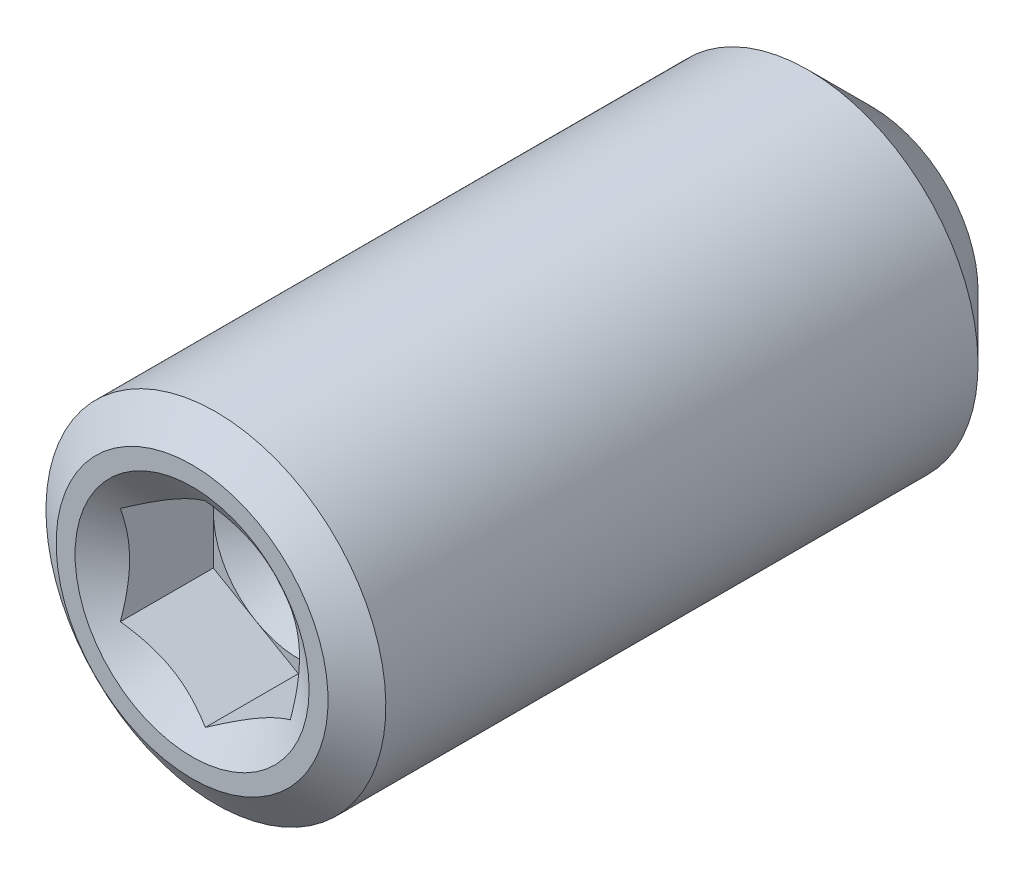
ISO-10303-21;
HEADER;
FILE_DESCRIPTION(('STEP AP214'),'2;1');
FILE_NAME('part.step','',(''),(''),'','','');
FILE_SCHEMA(('AUTOMOTIVE_DESIGN { 1 0 10303 214 1 1 1 1 }'));
ENDSEC;
DATA;
#1=APPLICATION_CONTEXT('core data for automotive mechanical design processes');
#2=APPLICATION_PROTOCOL_DEFINITION('international standard','automotive_design',2000,#1);
#3=PRODUCT_CONTEXT('',#1,'mechanical');
#4=PRODUCT('Part','Part','',(#3));
#5=PRODUCT_RELATED_PRODUCT_CATEGORY('part','',(#4));
#6=PRODUCT_DEFINITION_FORMATION('','',#4);
#7=PRODUCT_DEFINITION_CONTEXT('part definition',#1,'design');
#8=PRODUCT_DEFINITION('design','',#6,#7);
#9=PRODUCT_DEFINITION_SHAPE('','',#8);
#10=(LENGTH_UNIT() NAMED_UNIT(*) SI_UNIT(.MILLI.,.METRE.));
#11=(NAMED_UNIT(*) PLANE_ANGLE_UNIT() SI_UNIT($,.RADIAN.));
#12=(NAMED_UNIT(*) SI_UNIT($,.STERADIAN.) SOLID_ANGLE_UNIT());
#13=UNCERTAINTY_MEASURE_WITH_UNIT(LENGTH_MEASURE(1.E-05),#10,'distance_accuracy_value','');
#14=(GEOMETRIC_REPRESENTATION_CONTEXT(3) GLOBAL_UNCERTAINTY_ASSIGNED_CONTEXT((#13)) GLOBAL_UNIT_ASSIGNED_CONTEXT((#10,
#11,#12)) REPRESENTATION_CONTEXT('',''));
#15=CARTESIAN_POINT('',(0.,0.,0.));
#16=DIRECTION('',(0.,0.,1.));
#17=DIRECTION('',(1.,0.,0.));
#18=AXIS2_PLACEMENT_3D('',#15,#16,#17);
#19=CARTESIAN_POINT('',(0.,0.,1.84333410878658));
#20=DIRECTION('',(0.,0.,1.));
#21=DIRECTION('',(1.,0.,0.));
#22=AXIS2_PLACEMENT_3D('',#19,#20,#21);
#23=PLANE('',#22);
#24=CARTESIAN_POINT('',(0.,0.,1.84333410878658));
#25=DIRECTION('',(0.,0.,1.));
#26=DIRECTION('',(1.,0.,0.));
#27=AXIS2_PLACEMENT_3D('',#24,#25,#26);
#28=CIRCLE('',#27,0.75);
#29=CARTESIAN_POINT('',(0.75,0.,1.84333410878658));
#30=VERTEX_POINT('',#29);
#31=CARTESIAN_POINT('',(0.375000000000002,0.649519052838334,1.84333410878658));
#32=VERTEX_POINT('',#31);
#33=EDGE_CURVE('E129',#30,#32,#28,.T.);
#34=ORIENTED_EDGE('',*,*,#33,.F.);
#35=DIRECTION('',(0.,1.,0.));
#36=VECTOR('',#35,1.);
#37=CARTESIAN_POINT('',(0.75,-0.433012701892215,1.84333410878658));
#38=LINE('',#37,#36);
#39=CARTESIAN_POINT('',(0.75,0.433012701892224,1.84333410878658));
#40=VERTEX_POINT('',#39);
#41=EDGE_CURVE('E160',#30,#40,#38,.T.);
#42=ORIENTED_EDGE('',*,*,#41,.T.);
#43=DIRECTION('',(-0.866025403784438,0.5,0.));
#44=VECTOR('',#43,1.);
#45=CARTESIAN_POINT('',(0.75,0.433012701892224,1.84333410878658));
#46=LINE('',#45,#44);
#47=EDGE_CURVE('E154',#40,#32,#46,.T.);
#48=ORIENTED_EDGE('',*,*,#47,.T.);
#49=EDGE_LOOP('',(#34,#42,#48));
#50=FACE_BOUND('',#49,.T.);
#51=ADVANCED_FACE('F43',(#50),#23,.T.);
#52=CARTESIAN_POINT('',(-0.375000000000001,0.649519052838333,1.84333410878658));
#53=VERTEX_POINT('',#52);
#54=EDGE_CURVE('E131',#32,#53,#28,.T.);
#55=ORIENTED_EDGE('',*,*,#54,.F.);
#56=CARTESIAN_POINT('',(0.,0.866025403784444,1.84333410878658));
#57=VERTEX_POINT('',#56);
#58=EDGE_CURVE('E144',#32,#57,#46,.T.);
#59=ORIENTED_EDGE('',*,*,#58,.T.);
#60=DIRECTION('',(-0.866025403784439,-0.5,0.));
#61=VECTOR('',#60,1.);
#62=CARTESIAN_POINT('',(0.,0.866025403784444,1.84333410878658));
#63=LINE('',#62,#61);
#64=EDGE_CURVE('E147',#57,#53,#63,.T.);
#65=ORIENTED_EDGE('',*,*,#64,.T.);
#66=EDGE_LOOP('',(#55,#59,#65));
#67=FACE_BOUND('',#66,.T.);
#68=ADVANCED_FACE('F143',(#67),#23,.T.);
#69=CARTESIAN_POINT('',(-0.75,0.,1.84333410878658));
#70=VERTEX_POINT('',#69);
#71=EDGE_CURVE('E149',#53,#70,#28,.T.);
#72=ORIENTED_EDGE('',*,*,#71,.F.);
#73=CARTESIAN_POINT('',(-0.75,0.433012701892225,1.84333410878658));
#74=VERTEX_POINT('',#73);
#75=EDGE_CURVE('E163',#53,#74,#63,.T.);
#76=ORIENTED_EDGE('',*,*,#75,.T.);
#77=DIRECTION('',(0.,-1.,0.));
#78=VECTOR('',#77,1.);
#79=CARTESIAN_POINT('',(-0.75,0.433012701892225,1.84333410878658));
#80=LINE('',#79,#78);
#81=EDGE_CURVE('E171',#74,#70,#80,.T.);
#82=ORIENTED_EDGE('',*,*,#81,.T.);
#83=EDGE_LOOP('',(#72,#76,#82));
#84=FACE_BOUND('',#83,.T.);
#85=ADVANCED_FACE('F246',(#84),#23,.T.);
#86=CARTESIAN_POINT('',(-0.374999999999999,-0.649519052838325,1.84333410878658));
#87=VERTEX_POINT('',#86);
#88=EDGE_CURVE('E268',#70,#87,#28,.T.);
#89=ORIENTED_EDGE('',*,*,#88,.F.);
#90=CARTESIAN_POINT('',(-0.75,-0.433012701892215,1.84333410878658));
#91=VERTEX_POINT('',#90);
#92=EDGE_CURVE('E170',#70,#91,#80,.T.);
#93=ORIENTED_EDGE('',*,*,#92,.T.);
#94=DIRECTION('',(0.866025403784438,-0.5,0.));
#95=VECTOR('',#94,1.);
#96=CARTESIAN_POINT('',(-0.75,-0.433012701892215,1.84333410878658));
#97=LINE('',#96,#95);
#98=EDGE_CURVE('E176',#91,#87,#97,.T.);
#99=ORIENTED_EDGE('',*,*,#98,.T.);
#100=EDGE_LOOP('',(#89,#93,#99));
#101=FACE_BOUND('',#100,.T.);
#102=ADVANCED_FACE('F258',(#101),#23,.T.);
#103=CARTESIAN_POINT('',(0.374999999999999,-0.649519052838325,1.84333410878658));
#104=VERTEX_POINT('',#103);
#105=EDGE_CURVE('E65',#87,#104,#28,.T.);
#106=ORIENTED_EDGE('',*,*,#105,.F.);
#107=CARTESIAN_POINT('',(0.,-0.866025403784434,1.84333410878658));
#108=VERTEX_POINT('',#107);
#109=EDGE_CURVE('E175',#87,#108,#97,.T.);
#110=ORIENTED_EDGE('',*,*,#109,.T.);
#111=DIRECTION('',(0.866025403784439,0.5,0.));
#112=VECTOR('',#111,1.);
#113=CARTESIAN_POINT('',(0.,-0.866025403784434,1.84333410878658));
#114=LINE('',#113,#112);
#115=EDGE_CURVE('E181',#108,#104,#114,.T.);
#116=ORIENTED_EDGE('',*,*,#115,.T.);
#117=EDGE_LOOP('',(#106,#110,#116));
#118=FACE_BOUND('',#117,.T.);
#119=ADVANCED_FACE('F238',(#118),#23,.T.);
#120=CARTESIAN_POINT('',(0.,0.,-2.46916589121342));
#121=DIRECTION('',(0.,0.,-1.));
#122=DIRECTION('',(0.,1.,0.));
#123=AXIS2_PLACEMENT_3D('',#120,#121,#122);
#124=TOROIDAL_SURFACE('',#123,0.937500000000004,0.75);
#125=CARTESIAN_POINT('',(0.,0.,-3.21916589121342));
#126=DIRECTION('',(0.,0.,-1.));
#127=DIRECTION('',(0.,1.,0.));
#128=AXIS2_PLACEMENT_3D('',#125,#126,#127);
#129=CIRCLE('',#128,0.937500000000004);
#130=CARTESIAN_POINT('',(0.,0.9375,-3.21916589121342));
#131=VERTEX_POINT('',#130);
#132=EDGE_CURVE('E58',#131,#131,#129,.T.);
#133=ORIENTED_EDGE('',*,*,#132,.T.);
#134=EDGE_LOOP('',(#133));
#135=FACE_BOUND('',#134,.T.);
#136=CARTESIAN_POINT('',(0.,0.,-3.11204136674));
#137=DIRECTION('',(0.,0.,-1.));
#138=DIRECTION('',(0.,1.,0.));
#139=AXIS2_PLACEMENT_3D('',#136,#137,#138);
#140=CIRCLE('',#139,0.551221443817465);
#141=CARTESIAN_POINT('',(0.,0.551221443817462,-3.11204136674));
#142=VERTEX_POINT('',#141);
#143=EDGE_CURVE('E190',#142,#142,#140,.T.);
#144=ORIENTED_EDGE('',*,*,#143,.F.);
#145=EDGE_LOOP('',(#144));
#146=FACE_BOUND('',#145,.T.);
#147=ADVANCED_FACE('F45',(#135,#146),#124,.T.);
#148=CARTESIAN_POINT('',(0.,0.,-3.21916589121342));
#149=DIRECTION('',(0.,0.,1.));
#150=DIRECTION('',(0.,-1.,0.));
#151=AXIS2_PLACEMENT_3D('',#148,#149,#150);
#152=CONICAL_SURFACE('',#151,0.937500000000004,0.785398163397454);
#153=CARTESIAN_POINT('',(0.,0.,-2.65666589121343));
#154=DIRECTION('',(0.,0.,-1.));
#155=DIRECTION('',(0.,1.,0.));
#156=AXIS2_PLACEMENT_3D('',#153,#154,#155);
#157=CIRCLE('',#156,1.5);
#158=CARTESIAN_POINT('',(0.,1.5,-2.65666589121343));
#159=VERTEX_POINT('',#158);
#160=EDGE_CURVE('E218',#159,#159,#157,.T.);
#161=ORIENTED_EDGE('',*,*,#160,.T.);
#162=EDGE_LOOP('',(#161));
#163=FACE_BOUND('',#162,.T.);
#164=ORIENTED_EDGE('',*,*,#132,.F.);
#165=EDGE_LOOP('',(#164));
#166=FACE_BOUND('',#165,.T.);
#167=ADVANCED_FACE('F227',(#163,#166),#152,.T.);
#168=CARTESIAN_POINT('',(0.,0.,-2.78083410878658));
#169=DIRECTION('',(0.,0.,-1.));
#170=DIRECTION('',(0.,1.,0.));
#171=AXIS2_PLACEMENT_3D('',#168,#169,#170);
#172=CYLINDRICAL_SURFACE('',#171,1.5);
#173=CARTESIAN_POINT('',(0.,0.,2.57077184732367));
#174=DIRECTION('',(0.,0.,-1.));
#175=DIRECTION('',(0.,1.,0.));
#176=AXIS2_PLACEMENT_3D('',#173,#174,#175);
#177=CIRCLE('',#176,1.5);
#178=CARTESIAN_POINT('',(0.,1.5,2.57077184732367));
#179=VERTEX_POINT('',#178);
#180=EDGE_CURVE('E214',#179,#179,#177,.T.);
#181=ORIENTED_EDGE('',*,*,#180,.T.);
#182=EDGE_LOOP('',(#181));
#183=FACE_BOUND('',#182,.T.);
#184=ORIENTED_EDGE('',*,*,#160,.F.);
#185=EDGE_LOOP('',(#184));
#186=FACE_BOUND('',#185,.T.);
#187=ADVANCED_FACE('F229',(#183,#186),#172,.T.);
#188=CARTESIAN_POINT('',(0.,0.,2.57077184732367));
#189=DIRECTION('',(0.,0.,-1.));
#190=DIRECTION('',(0.,1.,0.));
#191=AXIS2_PLACEMENT_3D('',#188,#189,#190);
#192=CONICAL_SURFACE('',#191,1.5,0.959931088596886);
#193=CARTESIAN_POINT('',(0.,0.,2.78083410878658));
#194=DIRECTION('',(0.,0.,-1.));
#195=DIRECTION('',(0.,1.,0.));
#196=AXIS2_PLACEMENT_3D('',#193,#194,#195);
#197=CIRCLE('',#196,1.2);
#198=CARTESIAN_POINT('',(0.,1.2,2.78083410878658));
#199=VERTEX_POINT('',#198);
#200=EDGE_CURVE('E210',#199,#199,#197,.T.);
#201=ORIENTED_EDGE('',*,*,#200,.T.);
#202=EDGE_LOOP('',(#201));
#203=FACE_BOUND('',#202,.T.);
#204=ORIENTED_EDGE('',*,*,#180,.F.);
#205=EDGE_LOOP('',(#204));
#206=FACE_BOUND('',#205,.T.);
#207=ADVANCED_FACE('F235',(#203,#206),#192,.T.);
#208=CARTESIAN_POINT('',(0.,0.,2.78083410878658));
#209=DIRECTION('',(0.,0.,1.));
#210=DIRECTION('',(0.,-1.,0.));
#211=AXIS2_PLACEMENT_3D('',#208,#209,#210);
#212=PLANE('',#211);
#213=CARTESIAN_POINT('',(0.,0.,2.78083410878658));
#214=DIRECTION('',(0.,0.,1.));
#215=DIRECTION('',(1.,0.,0.));
#216=AXIS2_PLACEMENT_3D('',#213,#214,#215);
#217=CIRCLE('',#216,1.03301270189222);
#218=CARTESIAN_POINT('',(1.03301270189222,0.,2.78083410878658));
#219=VERTEX_POINT('',#218);
#220=EDGE_CURVE('E138',#219,#219,#217,.T.);
#221=ORIENTED_EDGE('',*,*,#220,.F.);
#222=EDGE_LOOP('',(#221));
#223=FACE_BOUND('',#222,.T.);
#224=ORIENTED_EDGE('',*,*,#200,.F.);
#225=EDGE_LOOP('',(#224));
#226=FACE_BOUND('',#225,.T.);
#227=ADVANCED_FACE('F367',(#223,#226),#212,.T.);
#228=CARTESIAN_POINT('',(0.,0.,-2.78083410878658));
#229=DIRECTION('',(0.,0.,-1.));
#230=DIRECTION('',(0.,1.,0.));
#231=AXIS2_PLACEMENT_3D('',#228,#229,#230);
#232=CONICAL_SURFACE('',#231,0.,1.02974425867666);
#233=ORIENTED_EDGE('',*,*,#143,.T.);
#234=EDGE_LOOP('',(#233));
#235=FACE_BOUND('',#234,.T.);
#236=CARTESIAN_POINT('',(0.,0.,-2.78083410878658));
#237=VERTEX_POINT('',#236);
#238=VERTEX_LOOP('',#237);
#239=FACE_BOUND('',#238,.T.);
#240=ADVANCED_FACE('F256',(#235,#239),#232,.F.);
#241=CARTESIAN_POINT('',(0.,0.,2.78083410878658));
#242=DIRECTION('',(0.,0.,1.));
#243=DIRECTION('',(1.,0.,0.));
#244=AXIS2_PLACEMENT_3D('',#241,#242,#243);
#245=CONICAL_SURFACE('',#244,1.03301270189222,0.959931088596883);
#246=ORIENTED_EDGE('',*,*,#220,.T.);
#247=EDGE_LOOP('',(#246));
#248=FACE_BOUND('',#247,.T.);
#249=CARTESIAN_POINT('',(-0.000200000000000538,-0.866140873838272,2.66398921303681));
#250=CARTESIAN_POINT('',(0.0334030394258943,-0.846740149980142,2.65039771018566));
#251=CARTESIAN_POINT('',(0.0674324226187356,-0.827093276433398,2.63800217682029));
#252=CARTESIAN_POINT('',(0.13637354152091,-0.787290102876994,2.61639518992572));
#253=CARTESIAN_POINT('',(0.17128818630068,-0.767132123314734,2.60719626574768));
#254=CARTESIAN_POINT('',(0.240480176225689,-0.727184109305764,2.59315425626621));
#255=CARTESIAN_POINT('',(0.274734216412612,-0.707407529983012,2.58816433917146));
#256=CARTESIAN_POINT('',(0.343450454299067,-0.667734191541569,2.58256201650789));
#257=CARTESIAN_POINT('',(0.377912088201103,-0.647837757931514,2.58194074414635));
#258=CARTESIAN_POINT('',(0.440691256870876,-0.611592188000519,2.58484525017326));
#259=CARTESIAN_POINT('',(0.469035439017862,-0.595227666807997,2.58766888010408));
#260=CARTESIAN_POINT('',(0.525414256136667,-0.562677341567863,2.59609846821847));
#261=CARTESIAN_POINT('',(0.553448808009573,-0.54649158549743,2.60170515562309));
#262=CARTESIAN_POINT('',(0.60995901457663,-0.513865402523978,2.61553159599329));
#263=CARTESIAN_POINT('',(0.638419954581955,-0.497433471150514,2.62382942962561));
#264=CARTESIAN_POINT('',(0.694743568497362,-0.464915017494721,2.64248324144884));
#265=CARTESIAN_POINT('',(0.72260777539989,-0.448827610138791,2.65283299839517));
#266=CARTESIAN_POINT('',(0.7502,-0.432897231838377,2.66398921303681));
#267=B_SPLINE_CURVE_WITH_KNOTS('',3,(#249,#250,#251,#252,#253,#254,#255,#256,#257,#258,#259,
#260,#261,#262,#263,#264,#265,#266),.UNSPECIFIED.,.F.,.F.,(4,2,2,2,2,2,2,2,4),(0.,
0.123425608117067,0.247329675410787,0.366707916689494,0.485843792541708,0.584269081045862,
0.682720172720861,0.784330602778694,0.885637545037813),.UNSPECIFIED.);
#268=CARTESIAN_POINT('',(0.,-0.866025403784434,2.66390834386623));
#269=VERTEX_POINT('',#268);
#270=CARTESIAN_POINT('',(0.75,-0.433012701892215,2.66390834386624));
#271=VERTEX_POINT('',#270);
#272=EDGE_CURVE('E285',#269,#271,#267,.T.);
#273=ORIENTED_EDGE('',*,*,#272,.F.);
#274=CARTESIAN_POINT('',(-0.7502,-0.432897231838377,2.66398921303681));
#275=CARTESIAN_POINT('',(-0.716596960574105,-0.452297955696507,2.65039771018566));
#276=CARTESIAN_POINT('',(-0.682567577381264,-0.471944829243251,2.63800217682029));
#277=CARTESIAN_POINT('',(-0.613626458479089,-0.511748002799655,2.61639518992572));
#278=CARTESIAN_POINT('',(-0.578711813699319,-0.531905982361916,2.60719626574768));
#279=CARTESIAN_POINT('',(-0.50951982377431,-0.571853996370886,2.59315425626621));
#280=CARTESIAN_POINT('',(-0.475265783587387,-0.591630575693638,2.58816433917146));
#281=CARTESIAN_POINT('',(-0.406549545700932,-0.631303914135081,2.58256201650789));
#282=CARTESIAN_POINT('',(-0.372087911798896,-0.651200347745136,2.58194074414635));
#283=CARTESIAN_POINT('',(-0.309308743129123,-0.687445917676131,2.58484525017326));
#284=CARTESIAN_POINT('',(-0.280964560982137,-0.703810438868652,2.58766888010407));
#285=CARTESIAN_POINT('',(-0.224585743863333,-0.736360764108787,2.59609846821847));
#286=CARTESIAN_POINT('',(-0.196551191990427,-0.75254652017922,2.60170515562309));
#287=CARTESIAN_POINT('',(-0.14004098542337,-0.785172703152672,2.61553159599329));
#288=CARTESIAN_POINT('',(-0.111580045418045,-0.801604634526136,2.62382942962561));
#289=CARTESIAN_POINT('',(-0.0552564315026386,-0.834123088181928,2.64248324144884));
#290=CARTESIAN_POINT('',(-0.0273922246001108,-0.850210495537858,2.65283299839517));
#291=CARTESIAN_POINT('',(0.000199999999999504,-0.866140873838272,2.66398921303681));
#292=B_SPLINE_CURVE_WITH_KNOTS('',3,(#274,#275,#276,#277,#278,#279,#280,#281,#282,#283,#284,
#285,#286,#287,#288,#289,#290,#291),.UNSPECIFIED.,.F.,.F.,(4,2,2,2,2,2,2,2,4),(0.,
0.123425608117067,0.247329675410787,0.366707916689495,0.485843792541709,0.584269081045862,
0.682720172720861,0.784330602778694,0.885637545037811),.UNSPECIFIED.);
#293=CARTESIAN_POINT('',(-0.75,-0.433012701892629,2.66390834386605));
#294=VERTEX_POINT('',#293);
#295=EDGE_CURVE('E283',#294,#269,#292,.T.);
#296=ORIENTED_EDGE('',*,*,#295,.F.);
#297=CARTESIAN_POINT('',(-0.75,-1.10287057158049,2.9913954212885));
#298=CARTESIAN_POINT('',(-0.75,-1.07323249379632,2.97423749905992));
#299=CARTESIAN_POINT('',(-0.75,-1.04350246804722,2.95723904824468));
#300=CARTESIAN_POINT('',(-0.75,-0.983811863427969,2.92363930040218));
#301=CARTESIAN_POINT('',(-0.75,-0.953851243150669,2.90703807701188));
#302=CARTESIAN_POINT('',(-0.75,-0.86319378861659,2.85775255350306));
#303=CARTESIAN_POINT('',(-0.75,-0.802090772646358,2.82580293796898));
#304=CARTESIAN_POINT('',(-0.75,-0.675610052910453,2.76358292393291));
#305=CARTESIAN_POINT('',(-0.75,-0.610163319827167,2.73345127131299));
#306=CARTESIAN_POINT('',(-0.75,-0.477056559887279,2.67875980503628));
#307=CARTESIAN_POINT('',(-0.75,-0.409402905073066,2.65418533785293));
#308=CARTESIAN_POINT('',(-0.75,-0.304573448741099,2.62386185695723));
#309=CARTESIAN_POINT('',(-0.75,-0.268386362179528,2.61474283722536));
#310=CARTESIAN_POINT('',(-0.75,-0.19535555606598,2.5996395664039));
#311=CARTESIAN_POINT('',(-0.75,-0.158512013651907,2.5936544825136));
#312=CARTESIAN_POINT('',(-0.75,-0.0850631625361548,2.58543576365699));
#313=CARTESIAN_POINT('',(-0.75,-0.0484653455895828,2.58313705574081));
#314=CARTESIAN_POINT('',(-0.75,0.0247760725287337,2.58232688031367));
#315=CARTESIAN_POINT('',(-0.75,0.0614196773951397,2.58381574119973));
#316=CARTESIAN_POINT('',(-0.75,0.138379257876457,2.59078991662694));
#317=CARTESIAN_POINT('',(-0.75,0.178656302404933,2.59669641105067));
#318=CARTESIAN_POINT('',(-0.75,0.258455152822717,2.61232337580151));
#319=CARTESIAN_POINT('',(-0.75,0.297976625876834,2.62204548810978));
#320=CARTESIAN_POINT('',(-0.75,0.377173920199997,2.64477548222504));
#321=CARTESIAN_POINT('',(-0.75,0.416826273505543,2.6578633293681));
#322=CARTESIAN_POINT('',(-0.75,0.495253485884142,2.68639444498232));
#323=CARTESIAN_POINT('',(-0.75,0.534028441588382,2.70183745260633));
#324=CARTESIAN_POINT('',(-0.75,0.616526486839045,2.73688308316567));
#325=CARTESIAN_POINT('',(-0.749999999999999,0.660130589339576,2.75676293927344));
#326=CARTESIAN_POINT('',(-0.749999999999999,0.746557229164207,2.79816373785642));
#327=CARTESIAN_POINT('',(-0.749999999999999,0.789379556512257,2.81968511341652));
#328=CARTESIAN_POINT('',(-0.749999999999999,0.917009190043905,2.88604289467139));
#329=CARTESIAN_POINT('',(-0.749999999999999,1.00089789901003,2.93263623503922));
#330=CARTESIAN_POINT('',(-0.749999999999999,1.16748563606949,3.02858287398175));
#331=CARTESIAN_POINT('',(-0.749999999999999,1.25017875078076,3.0779462246926));
#332=CARTESIAN_POINT('',(-0.749999999999999,1.4145443398443,3.17823968842829));
#333=CARTESIAN_POINT('',(-0.749999999999999,1.49621735327665,3.22916892001761));
#334=CARTESIAN_POINT('',(-0.749999999999999,1.6465787345634,3.32425812171767));
#335=CARTESIAN_POINT('',(-0.749999999999999,1.71535875134744,3.36827399827009));
#336=CARTESIAN_POINT('',(-0.749999999999999,1.85258286680394,3.4568500204641));
#337=CARTESIAN_POINT('',(-0.749999999999999,1.92102690982464,3.50141025227533));
#338=CARTESIAN_POINT('',(-0.749999999999999,2.05714963323975,3.59059615378216));
#339=CARTESIAN_POINT('',(-0.749999999999999,2.12483023061857,3.63521890291999));
#340=CARTESIAN_POINT('',(-0.749999999999999,2.25997771184879,3.72475975490696));
#341=CARTESIAN_POINT('',(-0.749999999999999,2.32744463317567,3.76967780116692));
#342=CARTESIAN_POINT('',(-0.749999999999999,2.39483863852832,3.81470422540189));
#343=B_SPLINE_CURVE_WITH_KNOTS('',3,(#297,#298,#299,#300,#301,#302,#303,#304,#305,#306,#307,
#308,#309,#310,#311,#312,#313,#314,#315,#316,#317,#318,#319,#320,#321,#322,#323,#324,#325,#326,
#327,#328,#329,#330,#331,#332,#333,#334,#335,#336,#337,#338,#339,#340,#341,#342),.UNSPECIFIED.,
.F.,.F.,(4,2,2,2,2,2,2,2,2,2,2,2,2,2,2,2,2,2,2,2,2,2,4),(0.,0.102737158089986,0.20549321603713,
0.412289500516019,0.628322586334481,0.843779202294508,0.955625192120492,1.06744144529753,
1.17726125466757,1.28709058616943,1.40898872750828,1.5309393830947,1.65610940159613,
1.78126556687486,1.92498281088575,2.06873810409863,2.35651572617434,2.64541531880134,
2.93415516417319,3.17912772697717,3.42413958399867,3.66733963831327,3.91049437195369),.UNSPECIFIED.);
#344=CARTESIAN_POINT('',(-0.75,0.433012701892225,2.66390834386624));
#345=VERTEX_POINT('',#344);
#346=EDGE_CURVE('E282',#345,#294,#343,.F.);
#347=ORIENTED_EDGE('',*,*,#346,.F.);
#348=CARTESIAN_POINT('',(0.000200000000000429,0.866140873838282,2.66398921303682));
#349=CARTESIAN_POINT('',(-0.0334030394258947,0.846740149980152,2.65039771018566));
#350=CARTESIAN_POINT('',(-0.0674324226187364,0.827093276433408,2.6380021768203));
#351=CARTESIAN_POINT('',(-0.136373541520911,0.787290102877003,2.61639518992573));
#352=CARTESIAN_POINT('',(-0.171288186300682,0.767132123314742,2.60719626574768));
#353=CARTESIAN_POINT('',(-0.240480176225691,0.727184109305772,2.59315425626621));
#354=CARTESIAN_POINT('',(-0.274734216412615,0.70740752998302,2.58816433917147));
#355=CARTESIAN_POINT('',(-0.34345045429907,0.667734191541576,2.5825620165079));
#356=CARTESIAN_POINT('',(-0.377912088201107,0.647837757931521,2.58194074414635));
#357=CARTESIAN_POINT('',(-0.44069125687088,0.611592188000527,2.58484525017327));
#358=CARTESIAN_POINT('',(-0.469035439017865,0.595227666808005,2.58766888010408));
#359=CARTESIAN_POINT('',(-0.52541425613667,0.562677341567871,2.59609846821848));
#360=CARTESIAN_POINT('',(-0.553448808009575,0.546491585497438,2.6017051556231));
#361=CARTESIAN_POINT('',(-0.609959014576632,0.513865402523987,2.6155315959933));
#362=CARTESIAN_POINT('',(-0.638419954581956,0.497433471150523,2.62382942962561));
#363=CARTESIAN_POINT('',(-0.694743568497362,0.464915017494731,2.64248324144885));
#364=CARTESIAN_POINT('',(-0.72260777539989,0.448827610138801,2.65283299839517));
#365=CARTESIAN_POINT('',(-0.7502,0.432897231838387,2.66398921303682));
#366=B_SPLINE_CURVE_WITH_KNOTS('',3,(#348,#349,#350,#351,#352,#353,#354,#355,#356,#357,#358,
#359,#360,#361,#362,#363,#364,#365),.UNSPECIFIED.,.F.,.F.,(4,2,2,2,2,2,2,2,4),(0.,
0.123425608117068,0.247329675410789,0.366707916689498,0.485843792541714,0.584269081045866,
0.682720172720864,0.784330602778695,0.885637545037811),.UNSPECIFIED.);
#367=CARTESIAN_POINT('',(0.,0.866025403784444,2.66390834386624));
#368=VERTEX_POINT('',#367);
#369=EDGE_CURVE('E73',#368,#345,#366,.T.);
#370=ORIENTED_EDGE('',*,*,#369,.F.);
#371=CARTESIAN_POINT('',(0.7502,0.432897231838386,2.66398921303682));
#372=CARTESIAN_POINT('',(0.716596960574105,0.452297955696517,2.65039771018566));
#373=CARTESIAN_POINT('',(0.682567577381264,0.471944829243261,2.63800217682029));
#374=CARTESIAN_POINT('',(0.613626458479089,0.511748002799665,2.61639518992573));
#375=CARTESIAN_POINT('',(0.578711813699318,0.531905982361926,2.60719626574768));
#376=CARTESIAN_POINT('',(0.509519823774309,0.571853996370896,2.59315425626621));
#377=CARTESIAN_POINT('',(0.475265783587385,0.591630575693649,2.58816433917147));
#378=CARTESIAN_POINT('',(0.40654954570093,0.631303914135092,2.5825620165079));
#379=CARTESIAN_POINT('',(0.372087911798894,0.651200347745147,2.58194074414635));
#380=CARTESIAN_POINT('',(0.30930874312912,0.687445917676141,2.58484525017327));
#381=CARTESIAN_POINT('',(0.280964560982135,0.703810438868663,2.58766888010408));
#382=CARTESIAN_POINT('',(0.224585743863331,0.736360764108798,2.59609846821848));
#383=CARTESIAN_POINT('',(0.196551191990425,0.75254652017923,2.6017051556231));
#384=CARTESIAN_POINT('',(0.140040985423369,0.785172703152682,2.6155315959933));
#385=CARTESIAN_POINT('',(0.111580045418044,0.801604634526146,2.62382942962562));
#386=CARTESIAN_POINT('',(0.0552564315026379,0.834123088181938,2.64248324144885));
#387=CARTESIAN_POINT('',(0.0273922246001104,0.850210495537868,2.65283299839517));
#388=CARTESIAN_POINT('',(-0.000199999999999703,0.866140873838282,2.66398921303682));
#389=B_SPLINE_CURVE_WITH_KNOTS('',3,(#371,#372,#373,#374,#375,#376,#377,#378,#379,#380,#381,
#382,#383,#384,#385,#386,#387,#388),.UNSPECIFIED.,.F.,.F.,(4,2,2,2,2,2,2,2,4),(0.,
0.123425608117068,0.247329675410789,0.366707916689497,0.485843792541712,0.584269081045865,
0.682720172720863,0.784330602778695,0.885637545037811),.UNSPECIFIED.);
#390=CARTESIAN_POINT('',(0.75,0.433012701892224,2.66390834386624));
#391=VERTEX_POINT('',#390);
#392=EDGE_CURVE('E11',#391,#368,#389,.T.);
#393=ORIENTED_EDGE('',*,*,#392,.F.);
#394=CARTESIAN_POINT('',(0.75,-1.10287057146359,2.99139542122082));
#395=CARTESIAN_POINT('',(0.75,-1.07323249368314,2.97423749899496));
#396=CARTESIAN_POINT('',(0.75,-1.04350246793776,2.95723904818245));
#397=CARTESIAN_POINT('',(0.75,-0.983811863325974,2.92363930034539));
#398=CARTESIAN_POINT('',(0.75,-0.953851243052413,2.9070380769578));
#399=CARTESIAN_POINT('',(0.75,-0.863193788529721,2.85775255345718));
#400=CARTESIAN_POINT('',(0.75,-0.802090772567174,2.82580293792854));
#401=CARTESIAN_POINT('',(0.75,-0.675610052848084,2.76358292390379));
#402=CARTESIAN_POINT('',(0.75,-0.610163319773961,2.73345127128968));
#403=CARTESIAN_POINT('',(0.75,-0.47705655985289,2.67875980502359));
#404=CARTESIAN_POINT('',(0.75,-0.409402905048325,2.65418533784506));
#405=CARTESIAN_POINT('',(0.75,-0.30457344872241,2.62386185695219));
#406=CARTESIAN_POINT('',(0.75,-0.268386362156767,2.61474283721986));
#407=CARTESIAN_POINT('',(0.75,-0.195355556034972,2.59963956639829));
#408=CARTESIAN_POINT('',(0.75,-0.158512013616726,2.59365448250836));
#409=CARTESIAN_POINT('',(0.75,-0.085063162492691,2.58543576365341));
#410=CARTESIAN_POINT('',(0.75,-0.0484653455420089,2.58313705573853));
#411=CARTESIAN_POINT('',(0.75,0.0247760725843553,2.58232688031481));
#412=CARTESIAN_POINT('',(0.75,0.0614196774546988,2.58381574120302));
#413=CARTESIAN_POINT('',(0.75,0.138379257944414,2.59078991663544));
#414=CARTESIAN_POINT('',(0.75,0.178656302477314,2.59669641106232));
#415=CARTESIAN_POINT('',(0.75,0.258455152903625,2.61232337581989));
#416=CARTESIAN_POINT('',(0.75,0.297976625961844,2.62204548813171));
#417=CARTESIAN_POINT('',(0.75,0.377173920293157,2.64477548225431));
#418=CARTESIAN_POINT('',(0.75,0.416826273602744,2.65786332940115));
#419=CARTESIAN_POINT('',(0.75,0.495253485989292,2.68639444502289));
#420=CARTESIAN_POINT('',(0.75,0.534028441697442,2.70183745265063));
#421=CARTESIAN_POINT('',(0.75,0.616526486950643,2.73688308321542));
#422=CARTESIAN_POINT('',(0.75,0.660130589449925,2.75676293932459));
#423=CARTESIAN_POINT('',(0.75,0.746557229272225,2.79816373790987));
#424=CARTESIAN_POINT('',(0.75,0.789379556619195,2.81968511347087));
#425=CARTESIAN_POINT('',(0.75,0.917009190147762,2.88604289472794));
#426=CARTESIAN_POINT('',(0.75,1.00089789911209,2.93263623509656));
#427=CARTESIAN_POINT('',(0.75,1.16748563616811,3.02858287403998));
#428=CARTESIAN_POINT('',(0.75,1.25017875087774,3.07794622475091));
#429=CARTESIAN_POINT('',(0.75,1.4145443399382,3.17823968848645));
#430=CARTESIAN_POINT('',(0.75,1.49621735336911,3.22916892007554));
#431=CARTESIAN_POINT('',(0.75,1.6465787346544,3.32425812177568));
#432=CARTESIAN_POINT('',(0.75,1.7153587514384,3.36827399832846));
#433=CARTESIAN_POINT('',(0.75,1.85258286689483,3.45685002052311));
#434=CARTESIAN_POINT('',(0.75,1.92102690991552,3.50141025233462));
#435=CARTESIAN_POINT('',(0.75,2.05714963333089,3.59059615384213));
#436=CARTESIAN_POINT('',(0.75,2.12483023070999,3.63521890298036));
#437=CARTESIAN_POINT('',(0.75,2.25997771194077,3.7247597549681));
#438=CARTESIAN_POINT('',(0.75,2.32744463326795,3.76967780122842));
#439=CARTESIAN_POINT('',(0.75,2.39483863862091,3.81470422546375));
#440=B_SPLINE_CURVE_WITH_KNOTS('',3,(#394,#395,#396,#397,#398,#399,#400,#401,#402,#403,#404,
#405,#406,#407,#408,#409,#410,#411,#412,#413,#414,#415,#416,#417,#418,#419,#420,#421,#422,#423,
#424,#425,#426,#427,#428,#429,#430,#431,#432,#433,#434,#435,#436,#437,#438,#439),.UNSPECIFIED.,
.F.,.F.,(4,2,2,2,2,2,2,2,2,2,2,2,2,2,2,2,2,2,2,2,2,2,4),(0.,0.102737158076229,0.205493216009615,
0.412289500460509,0.628322586246709,0.843779202174765,0.955625192012899,1.06744144520205,
1.17726125458408,1.28709058609795,1.40898872745126,1.53093938305219,1.65610940156869,
1.78126556686247,1.92498281087171,2.06873810408293,2.35651572615515,2.64541531877804,
2.93415516414588,3.17912772695032,3.42413958397224,3.66733963828818,3.91049437192996),.UNSPECIFIED.);
#441=EDGE_CURVE('E330',#271,#391,#440,.T.);
#442=ORIENTED_EDGE('',*,*,#441,.F.);
#443=EDGE_LOOP('',(#273,#296,#347,#370,#393,#442));
#444=FACE_BOUND('',#443,.T.);
#445=ADVANCED_FACE('F249',(#248,#444),#245,.F.);
#446=EDGE_CURVE('E133',#104,#30,#28,.T.);
#447=ORIENTED_EDGE('',*,*,#446,.F.);
#448=CARTESIAN_POINT('',(0.75,-0.433012701892215,1.84333410878658));
#449=VERTEX_POINT('',#448);
#450=EDGE_CURVE('E180',#104,#449,#114,.T.);
#451=ORIENTED_EDGE('',*,*,#450,.T.);
#452=EDGE_CURVE('E158',#449,#30,#38,.T.);
#453=ORIENTED_EDGE('',*,*,#452,.T.);
#454=EDGE_LOOP('',(#447,#451,#453));
#455=FACE_BOUND('',#454,.T.);
#456=ADVANCED_FACE('F241',(#455),#23,.T.);
#457=CARTESIAN_POINT('',(0.75,0.433012701892224,1.84333410878658));
#458=DIRECTION('',(0.5,0.866025403784438,0.));
#459=DIRECTION('',(-0.866025403784439,0.5,0.));
#460=AXIS2_PLACEMENT_3D('',#457,#458,#459);
#461=PLANE('',#460);
#462=DIRECTION('',(0.,0.,1.));
#463=VECTOR('',#462,1.);
#464=CARTESIAN_POINT('',(0.75,0.433012701892224,1.84333410878658));
#465=LINE('',#464,#463);
#466=EDGE_CURVE('E185',#40,#391,#465,.T.);
#467=ORIENTED_EDGE('',*,*,#466,.T.);
#468=ORIENTED_EDGE('',*,*,#392,.T.);
#469=DIRECTION('',(0.,0.,1.));
#470=VECTOR('',#469,1.);
#471=CARTESIAN_POINT('',(0.,0.866025403784444,1.84333410878658));
#472=LINE('',#471,#470);
#473=EDGE_CURVE('E156',#57,#368,#472,.T.);
#474=ORIENTED_EDGE('',*,*,#473,.F.);
#475=ORIENTED_EDGE('',*,*,#58,.F.);
#476=ORIENTED_EDGE('',*,*,#47,.F.);
#477=EDGE_LOOP('',(#467,#468,#474,#475,#476));
#478=FACE_BOUND('',#477,.T.);
#479=ADVANCED_FACE('F153',(#478),#461,.F.);
#480=CARTESIAN_POINT('',(0.,0.866025403784444,1.84333410878658));
#481=DIRECTION('',(-0.5,0.866025403784439,0.));
#482=DIRECTION('',(-0.866025403784439,-0.5,0.));
#483=AXIS2_PLACEMENT_3D('',#480,#481,#482);
#484=PLANE('',#483);
#485=ORIENTED_EDGE('',*,*,#473,.T.);
#486=ORIENTED_EDGE('',*,*,#369,.T.);
#487=DIRECTION('',(0.,0.,1.));
#488=VECTOR('',#487,1.);
#489=CARTESIAN_POINT('',(-0.75,0.433012701892225,1.84333410878658));
#490=LINE('',#489,#488);
#491=EDGE_CURVE('E199',#74,#345,#490,.T.);
#492=ORIENTED_EDGE('',*,*,#491,.F.);
#493=ORIENTED_EDGE('',*,*,#75,.F.);
#494=ORIENTED_EDGE('',*,*,#64,.F.);
#495=EDGE_LOOP('',(#485,#486,#492,#493,#494));
#496=FACE_BOUND('',#495,.T.);
#497=ADVANCED_FACE('F255',(#496),#484,.F.);
#498=CARTESIAN_POINT('',(-0.75,0.433012701892225,1.84333410878658));
#499=DIRECTION('',(-1.,0.,0.));
#500=DIRECTION('',(0.,-1.,0.));
#501=AXIS2_PLACEMENT_3D('',#498,#499,#500);
#502=PLANE('',#501);
#503=ORIENTED_EDGE('',*,*,#491,.T.);
#504=ORIENTED_EDGE('',*,*,#346,.T.);
#505=DIRECTION('',(0.,0.,1.));
#506=VECTOR('',#505,1.);
#507=CARTESIAN_POINT('',(-0.75,-0.433012701892215,1.84333410878658));
#508=LINE('',#507,#506);
#509=EDGE_CURVE('E195',#91,#294,#508,.T.);
#510=ORIENTED_EDGE('',*,*,#509,.F.);
#511=ORIENTED_EDGE('',*,*,#92,.F.);
#512=ORIENTED_EDGE('',*,*,#81,.F.);
#513=EDGE_LOOP('',(#503,#504,#510,#511,#512));
#514=FACE_BOUND('',#513,.T.);
#515=ADVANCED_FACE('F281',(#514),#502,.F.);
#516=CARTESIAN_POINT('',(-0.75,-0.433012701892215,1.84333410878658));
#517=DIRECTION('',(-0.5,-0.866025403784438,0.));
#518=DIRECTION('',(0.866025403784438,-0.5,0.));
#519=AXIS2_PLACEMENT_3D('',#516,#517,#518);
#520=PLANE('',#519);
#521=ORIENTED_EDGE('',*,*,#509,.T.);
#522=ORIENTED_EDGE('',*,*,#295,.T.);
#523=DIRECTION('',(0.,0.,1.));
#524=VECTOR('',#523,1.);
#525=CARTESIAN_POINT('',(0.,-0.866025403784434,1.84333410878658));
#526=LINE('',#525,#524);
#527=EDGE_CURVE('E191',#108,#269,#526,.T.);
#528=ORIENTED_EDGE('',*,*,#527,.F.);
#529=ORIENTED_EDGE('',*,*,#109,.F.);
#530=ORIENTED_EDGE('',*,*,#98,.F.);
#531=EDGE_LOOP('',(#521,#522,#528,#529,#530));
#532=FACE_BOUND('',#531,.T.);
#533=ADVANCED_FACE('F271',(#532),#520,.F.);
#534=CARTESIAN_POINT('',(0.,-0.866025403784434,1.84333410878658));
#535=DIRECTION('',(0.5,-0.866025403784439,0.));
#536=DIRECTION('',(0.866025403784439,0.5,0.));
#537=AXIS2_PLACEMENT_3D('',#534,#535,#536);
#538=PLANE('',#537);
#539=ORIENTED_EDGE('',*,*,#527,.T.);
#540=ORIENTED_EDGE('',*,*,#272,.T.);
#541=DIRECTION('',(0.,0.,1.));
#542=VECTOR('',#541,1.);
#543=CARTESIAN_POINT('',(0.75,-0.433012701892215,1.84333410878658));
#544=LINE('',#543,#542);
#545=EDGE_CURVE('E186',#449,#271,#544,.T.);
#546=ORIENTED_EDGE('',*,*,#545,.F.);
#547=ORIENTED_EDGE('',*,*,#450,.F.);
#548=ORIENTED_EDGE('',*,*,#115,.F.);
#549=EDGE_LOOP('',(#539,#540,#546,#547,#548));
#550=FACE_BOUND('',#549,.T.);
#551=ADVANCED_FACE('F289',(#550),#538,.F.);
#552=CARTESIAN_POINT('',(0.75,-0.433012701892215,1.84333410878658));
#553=DIRECTION('',(1.,0.,0.));
#554=DIRECTION('',(0.,0.,-1.));
#555=AXIS2_PLACEMENT_3D('',#552,#553,#554);
#556=PLANE('',#555);
#557=ORIENTED_EDGE('',*,*,#545,.T.);
#558=ORIENTED_EDGE('',*,*,#441,.T.);
#559=ORIENTED_EDGE('',*,*,#466,.F.);
#560=ORIENTED_EDGE('',*,*,#41,.F.);
#561=ORIENTED_EDGE('',*,*,#452,.F.);
#562=EDGE_LOOP('',(#557,#558,#559,#560,#561));
#563=FACE_BOUND('',#562,.T.);
#564=ADVANCED_FACE('F126',(#563),#556,.F.);
#565=CARTESIAN_POINT('',(0.,0.,1.84333410878658));
#566=DIRECTION('',(0.,0.,1.));
#567=DIRECTION('',(1.,0.,0.));
#568=AXIS2_PLACEMENT_3D('',#565,#566,#567);
#569=CONICAL_SURFACE('',#568,0.75,1.0471975511966);
#570=CARTESIAN_POINT('',(0.,0.,1.41032140689436));
#571=VERTEX_POINT('',#570);
#572=VERTEX_LOOP('',#571);
#573=FACE_BOUND('',#572,.T.);
#574=ORIENTED_EDGE('',*,*,#33,.T.);
#575=ORIENTED_EDGE('',*,*,#54,.T.);
#576=ORIENTED_EDGE('',*,*,#71,.T.);
#577=ORIENTED_EDGE('',*,*,#88,.T.);
#578=ORIENTED_EDGE('',*,*,#105,.T.);
#579=ORIENTED_EDGE('',*,*,#446,.T.);
#580=EDGE_LOOP('',(#574,#575,#576,#577,#578,#579));
#581=FACE_BOUND('',#580,.T.);
#582=ADVANCED_FACE('F124',(#573,#581),#569,.F.);
#583=CLOSED_SHELL('',(#51,#68,#85,#102,#119,#147,#167,#187,#207,#227,#240,#445,#456,#479,#497,
#515,#533,#551,#564,#582));
#584=MANIFOLD_SOLID_BREP('B2',#583);
#585=ADVANCED_BREP_SHAPE_REPRESENTATION('',(#18,#584),#14);
#586=SHAPE_DEFINITION_REPRESENTATION(#9,#585);
ENDSEC;
END-ISO-10303-21;
